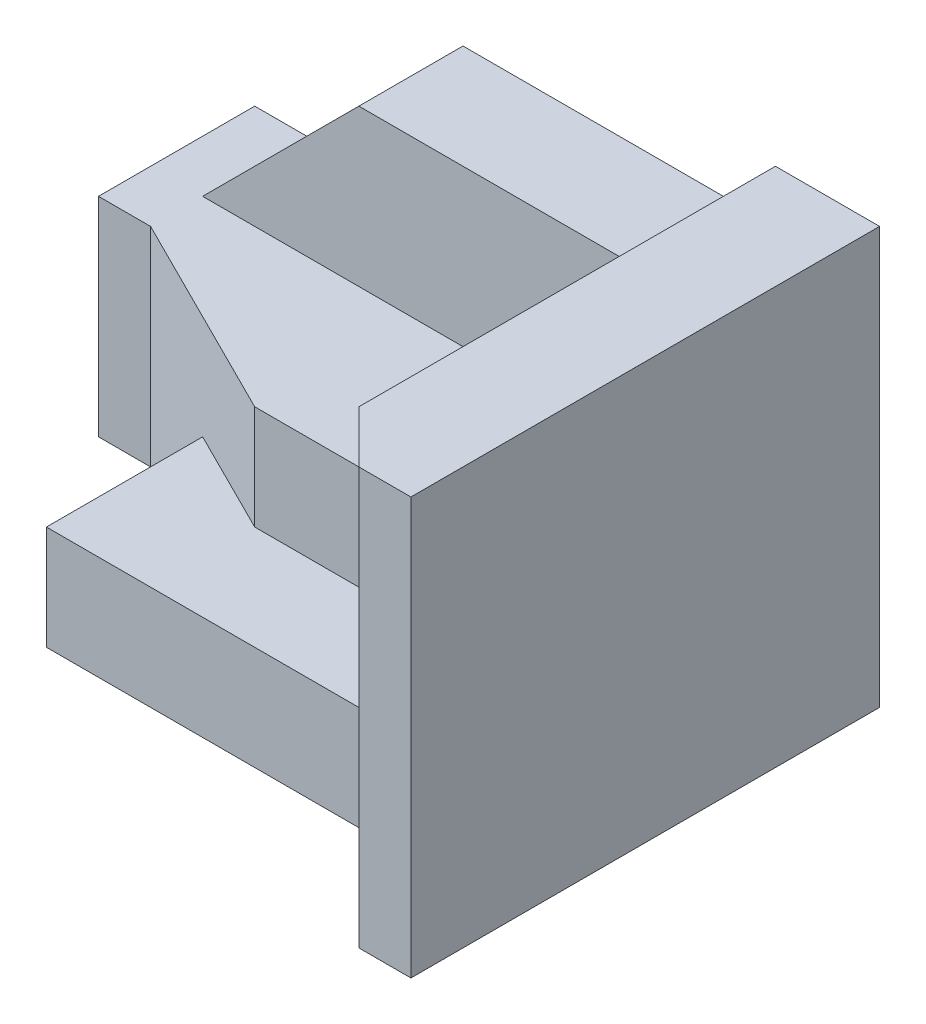
ISO-10303-21;
HEADER;
FILE_DESCRIPTION(('STEP AP214'),'2;1');
FILE_NAME('part.step','',(''),(''),'','','');
FILE_SCHEMA(('AUTOMOTIVE_DESIGN { 1 0 10303 214 1 1 1 1 }'));
ENDSEC;
DATA;
#1=APPLICATION_CONTEXT('core data for automotive mechanical design processes');
#2=APPLICATION_PROTOCOL_DEFINITION('international standard','automotive_design',2000,#1);
#3=PRODUCT_CONTEXT('',#1,'mechanical');
#4=PRODUCT('Part','Part','',(#3));
#5=PRODUCT_RELATED_PRODUCT_CATEGORY('part','',(#4));
#6=PRODUCT_DEFINITION_FORMATION('','',#4);
#7=PRODUCT_DEFINITION_CONTEXT('part definition',#1,'design');
#8=PRODUCT_DEFINITION('design','',#6,#7);
#9=PRODUCT_DEFINITION_SHAPE('','',#8);
#10=(LENGTH_UNIT() NAMED_UNIT(*) SI_UNIT(.MILLI.,.METRE.));
#11=(NAMED_UNIT(*) PLANE_ANGLE_UNIT() SI_UNIT($,.RADIAN.));
#12=(NAMED_UNIT(*) SI_UNIT($,.STERADIAN.) SOLID_ANGLE_UNIT());
#13=UNCERTAINTY_MEASURE_WITH_UNIT(LENGTH_MEASURE(1.E-05),#10,'distance_accuracy_value','');
#14=(GEOMETRIC_REPRESENTATION_CONTEXT(3) GLOBAL_UNCERTAINTY_ASSIGNED_CONTEXT((#13)) GLOBAL_UNIT_ASSIGNED_CONTEXT((#10,
#11,#12)) REPRESENTATION_CONTEXT('',''));
#15=CARTESIAN_POINT('',(0.,0.,0.));
#16=DIRECTION('',(0.,0.,1.));
#17=DIRECTION('',(1.,0.,0.));
#18=AXIS2_PLACEMENT_3D('',#15,#16,#17);
#19=CARTESIAN_POINT('',(90.,90.,-20.));
#20=DIRECTION('',(0.707106781186547,0.,-0.707106781186547));
#21=DIRECTION('',(-0.707106781186548,0.,-0.707106781186547));
#22=AXIS2_PLACEMENT_3D('',#19,#20,#21);
#23=PLANE('',#22);
#24=DIRECTION('',(0.577350269189626,0.577350269189626,0.577350269189626));
#25=VECTOR('',#24,1.);
#26=CARTESIAN_POINT('',(100.,70.,-10.));
#27=LINE('',#26,#25);
#28=CARTESIAN_POINT('',(70.,40.,-40.));
#29=VERTEX_POINT('',#28);
#30=CARTESIAN_POINT('',(100.,70.,-9.99999999999997));
#31=VERTEX_POINT('',#30);
#32=EDGE_CURVE('E308',#29,#31,#27,.T.);
#33=ORIENTED_EDGE('',*,*,#32,.F.);
#34=DIRECTION('',(0.,-1.,0.));
#35=VECTOR('',#34,1.);
#36=CARTESIAN_POINT('',(70.,110.,-40.));
#37=LINE('',#36,#35);
#38=CARTESIAN_POINT('',(70.,20.,-40.));
#39=VERTEX_POINT('',#38);
#40=EDGE_CURVE('E186',#29,#39,#37,.T.);
#41=ORIENTED_EDGE('',*,*,#40,.T.);
#42=DIRECTION('',(-0.707106781186548,0.,-0.707106781186547));
#43=VECTOR('',#42,1.);
#44=CARTESIAN_POINT('',(70.,20.,-40.));
#45=LINE('',#44,#43);
#46=CARTESIAN_POINT('',(90.,20.,-20.));
#47=VERTEX_POINT('',#46);
#48=EDGE_CURVE('E175',#47,#39,#45,.T.);
#49=ORIENTED_EDGE('',*,*,#48,.F.);
#50=DIRECTION('',(0.,-1.,0.));
#51=VECTOR('',#50,1.);
#52=CARTESIAN_POINT('',(90.,90.,-20.));
#53=LINE('',#52,#51);
#54=CARTESIAN_POINT('',(90.,0.,-20.));
#55=VERTEX_POINT('',#54);
#56=EDGE_CURVE('E207',#47,#55,#53,.T.);
#57=ORIENTED_EDGE('',*,*,#56,.T.);
#58=DIRECTION('',(0.707106781186548,0.,0.707106781186547));
#59=VECTOR('',#58,1.);
#60=CARTESIAN_POINT('',(90.,0.,-20.));
#61=LINE('',#60,#59);
#62=CARTESIAN_POINT('',(110.,0.,0.));
#63=VERTEX_POINT('',#62);
#64=EDGE_CURVE('E200',#55,#63,#61,.T.);
#65=ORIENTED_EDGE('',*,*,#64,.T.);
#66=DIRECTION('',(0.,-1.,0.));
#67=VECTOR('',#66,1.);
#68=CARTESIAN_POINT('',(110.,90.,0.));
#69=LINE('',#68,#67);
#70=CARTESIAN_POINT('',(110.,80.,0.));
#71=VERTEX_POINT('',#70);
#72=EDGE_CURVE('E203',#71,#63,#69,.T.);
#73=ORIENTED_EDGE('',*,*,#72,.F.);
#74=DIRECTION('',(-0.707106781186548,0.,-0.707106781186548));
#75=VECTOR('',#74,1.);
#76=CARTESIAN_POINT('',(9.99999999999999,80.,-100.));
#77=LINE('',#76,#75);
#78=CARTESIAN_POINT('',(100.,80.,-9.99999999999999));
#79=VERTEX_POINT('',#78);
#80=EDGE_CURVE('E218',#71,#79,#77,.T.);
#81=ORIENTED_EDGE('',*,*,#80,.T.);
#82=DIRECTION('',(0.,1.,0.));
#83=VECTOR('',#82,1.);
#84=CARTESIAN_POINT('',(100.,70.,-9.99999999999999));
#85=LINE('',#84,#83);
#86=EDGE_CURVE('E206',#31,#79,#85,.T.);
#87=ORIENTED_EDGE('',*,*,#86,.F.);
#88=EDGE_LOOP('',(#33,#41,#49,#57,#65,#73,#81,#87));
#89=FACE_BOUND('',#88,.T.);
#90=ADVANCED_FACE('F33',(#89),#23,.F.);
#91=CARTESIAN_POINT('',(40.,70.,-90.));
#92=DIRECTION('',(0.,-1.,0.));
#93=DIRECTION('',(0.,0.,-1.));
#94=AXIS2_PLACEMENT_3D('',#91,#92,#93);
#95=PLANE('',#94);
#96=DIRECTION('',(-1.,0.,0.));
#97=VECTOR('',#96,1.);
#98=CARTESIAN_POINT('',(40.,70.,-70.));
#99=LINE('',#98,#97);
#100=CARTESIAN_POINT('',(100.,70.,-70.));
#101=VERTEX_POINT('',#100);
#102=CARTESIAN_POINT('',(40.,70.,-70.));
#103=VERTEX_POINT('',#102);
#104=EDGE_CURVE('E169',#101,#103,#99,.T.);
#105=ORIENTED_EDGE('',*,*,#104,.F.);
#106=DIRECTION('',(0.,0.,1.));
#107=VECTOR('',#106,1.);
#108=CARTESIAN_POINT('',(100.,70.,-90.));
#109=LINE('',#108,#107);
#110=CARTESIAN_POINT('',(100.,70.,-90.));
#111=VERTEX_POINT('',#110);
#112=EDGE_CURVE('E237',#111,#101,#109,.T.);
#113=ORIENTED_EDGE('',*,*,#112,.F.);
#114=DIRECTION('',(1.,0.,0.));
#115=VECTOR('',#114,1.);
#116=CARTESIAN_POINT('',(40.,70.,-90.));
#117=LINE('',#116,#115);
#118=CARTESIAN_POINT('',(40.,70.,-90.));
#119=VERTEX_POINT('',#118);
#120=EDGE_CURVE('E226',#119,#111,#117,.T.);
#121=ORIENTED_EDGE('',*,*,#120,.F.);
#122=DIRECTION('',(0.,0.,1.));
#123=VECTOR('',#122,1.);
#124=CARTESIAN_POINT('',(40.,70.,-90.));
#125=LINE('',#124,#123);
#126=EDGE_CURVE('E239',#119,#103,#125,.T.);
#127=ORIENTED_EDGE('',*,*,#126,.T.);
#128=EDGE_LOOP('',(#105,#113,#121,#127));
#129=FACE_BOUND('',#128,.T.);
#130=ADVANCED_FACE('F307',(#129),#95,.F.);
#131=CARTESIAN_POINT('',(10.,40.,-90.));
#132=DIRECTION('',(0.707106781186547,-0.707106781186547,0.));
#133=DIRECTION('',(0.707106781186548,0.707106781186548,0.));
#134=AXIS2_PLACEMENT_3D('',#131,#132,#133);
#135=PLANE('',#134);
#136=DIRECTION('',(-0.707106781186547,-0.707106781186547,0.));
#137=VECTOR('',#136,1.);
#138=CARTESIAN_POINT('',(10.,40.,-70.));
#139=LINE('',#138,#137);
#140=CARTESIAN_POINT('',(10.,40.,-70.));
#141=VERTEX_POINT('',#140);
#142=EDGE_CURVE('E11',#103,#141,#139,.T.);
#143=ORIENTED_EDGE('',*,*,#142,.F.);
#144=ORIENTED_EDGE('',*,*,#126,.F.);
#145=DIRECTION('',(0.707106781186547,0.707106781186548,0.));
#146=VECTOR('',#145,1.);
#147=CARTESIAN_POINT('',(10.,40.,-90.));
#148=LINE('',#147,#146);
#149=CARTESIAN_POINT('',(10.,40.,-90.));
#150=VERTEX_POINT('',#149);
#151=EDGE_CURVE('E223',#150,#119,#148,.T.);
#152=ORIENTED_EDGE('',*,*,#151,.F.);
#153=DIRECTION('',(0.,0.,1.));
#154=VECTOR('',#153,1.);
#155=CARTESIAN_POINT('',(10.,40.,-90.));
#156=LINE('',#155,#154);
#157=EDGE_CURVE('E242',#150,#141,#156,.T.);
#158=ORIENTED_EDGE('',*,*,#157,.T.);
#159=EDGE_LOOP('',(#143,#144,#152,#158));
#160=FACE_BOUND('',#159,.T.);
#161=ADVANCED_FACE('F341',(#160),#135,.F.);
#162=CARTESIAN_POINT('',(10.,90.,-60.));
#163=DIRECTION('',(0.447213595499958,0.,-0.894427190999916));
#164=DIRECTION('',(-0.894427190999916,0.,-0.447213595499958));
#165=AXIS2_PLACEMENT_3D('',#162,#163,#164);
#166=PLANE('',#165);
#167=DIRECTION('',(0.894427190999916,0.,0.447213595499958));
#168=VECTOR('',#167,1.);
#169=CARTESIAN_POINT('',(10.,40.,-60.));
#170=LINE('',#169,#168);
#171=CARTESIAN_POINT('',(10.,40.,-60.));
#172=VERTEX_POINT('',#171);
#173=CARTESIAN_POINT('',(50.,40.,-40.));
#174=VERTEX_POINT('',#173);
#175=EDGE_CURVE('E48',#172,#174,#170,.T.);
#176=ORIENTED_EDGE('',*,*,#175,.F.);
#177=DIRECTION('',(0.,-1.,0.));
#178=VECTOR('',#177,1.);
#179=CARTESIAN_POINT('',(10.,90.,-60.));
#180=LINE('',#179,#178);
#181=CARTESIAN_POINT('',(10.,0.,-60.));
#182=VERTEX_POINT('',#181);
#183=EDGE_CURVE('E213',#172,#182,#180,.T.);
#184=ORIENTED_EDGE('',*,*,#183,.T.);
#185=DIRECTION('',(0.894427190999916,0.,0.447213595499958));
#186=VECTOR('',#185,1.);
#187=CARTESIAN_POINT('',(10.,0.,-60.));
#188=LINE('',#187,#186);
#189=CARTESIAN_POINT('',(30.,0.,-50.));
#190=VERTEX_POINT('',#189);
#191=EDGE_CURVE('E191',#182,#190,#188,.T.);
#192=ORIENTED_EDGE('',*,*,#191,.T.);
#193=DIRECTION('',(0.,-1.,0.));
#194=VECTOR('',#193,1.);
#195=CARTESIAN_POINT('',(30.,90.,-50.));
#196=LINE('',#195,#194);
#197=CARTESIAN_POINT('',(30.,20.,-50.));
#198=VERTEX_POINT('',#197);
#199=EDGE_CURVE('E211',#198,#190,#196,.T.);
#200=ORIENTED_EDGE('',*,*,#199,.F.);
#201=DIRECTION('',(-0.894427190999916,0.,-0.447213595499958));
#202=VECTOR('',#201,1.);
#203=CARTESIAN_POINT('',(30.,20.,-50.));
#204=LINE('',#203,#202);
#205=CARTESIAN_POINT('',(50.,20.,-40.));
#206=VERTEX_POINT('',#205);
#207=EDGE_CURVE('E180',#206,#198,#204,.T.);
#208=ORIENTED_EDGE('',*,*,#207,.F.);
#209=DIRECTION('',(0.,-1.,0.));
#210=VECTOR('',#209,1.);
#211=CARTESIAN_POINT('',(50.,110.,-40.));
#212=LINE('',#211,#210);
#213=EDGE_CURVE('E184',#174,#206,#212,.T.);
#214=ORIENTED_EDGE('',*,*,#213,.F.);
#215=EDGE_LOOP('',(#176,#184,#192,#200,#208,#214));
#216=FACE_BOUND('',#215,.T.);
#217=ADVANCED_FACE('F319',(#216),#166,.F.);
#218=CARTESIAN_POINT('',(50.,110.,-40.));
#219=DIRECTION('',(0.,0.,1.));
#220=DIRECTION('',(1.,0.,0.));
#221=AXIS2_PLACEMENT_3D('',#218,#219,#220);
#222=PLANE('',#221);
#223=ORIENTED_EDGE('',*,*,#40,.F.);
#224=DIRECTION('',(1.,0.,0.));
#225=VECTOR('',#224,1.);
#226=CARTESIAN_POINT('',(50.,40.,-40.));
#227=LINE('',#226,#225);
#228=EDGE_CURVE('E163',#174,#29,#227,.T.);
#229=ORIENTED_EDGE('',*,*,#228,.F.);
#230=ORIENTED_EDGE('',*,*,#213,.T.);
#231=DIRECTION('',(-1.,0.,0.));
#232=VECTOR('',#231,1.);
#233=CARTESIAN_POINT('',(50.,20.,-40.));
#234=LINE('',#233,#232);
#235=EDGE_CURVE('E177',#39,#206,#234,.T.);
#236=ORIENTED_EDGE('',*,*,#235,.F.);
#237=EDGE_LOOP('',(#223,#229,#230,#236));
#238=FACE_BOUND('',#237,.T.);
#239=ADVANCED_FACE('F316',(#238),#222,.T.);
#240=CARTESIAN_POINT('',(0.,0.,-90.));
#241=DIRECTION('',(-1.,0.,0.));
#242=DIRECTION('',(0.,0.,1.));
#243=AXIS2_PLACEMENT_3D('',#240,#241,#242);
#244=PLANE('',#243);
#245=DIRECTION('',(0.,-1.,0.));
#246=VECTOR('',#245,1.);
#247=CARTESIAN_POINT('',(0.,90.,-60.));
#248=LINE('',#247,#246);
#249=CARTESIAN_POINT('',(0.,40.,-60.));
#250=VERTEX_POINT('',#249);
#251=CARTESIAN_POINT('',(0.,0.,-60.));
#252=VERTEX_POINT('',#251);
#253=EDGE_CURVE('E202',#250,#252,#248,.T.);
#254=ORIENTED_EDGE('',*,*,#253,.F.);
#255=DIRECTION('',(0.,0.,1.));
#256=VECTOR('',#255,1.);
#257=CARTESIAN_POINT('',(0.,40.,-90.));
#258=LINE('',#257,#256);
#259=CARTESIAN_POINT('',(0.,40.,-90.));
#260=VERTEX_POINT('',#259);
#261=EDGE_CURVE('E232',#260,#250,#258,.T.);
#262=ORIENTED_EDGE('',*,*,#261,.F.);
#263=DIRECTION('',(0.,-1.,0.));
#264=VECTOR('',#263,1.);
#265=CARTESIAN_POINT('',(0.,0.,-90.));
#266=LINE('',#265,#264);
#267=CARTESIAN_POINT('',(0.,0.,-90.));
#268=VERTEX_POINT('',#267);
#269=EDGE_CURVE('E245',#260,#268,#266,.T.);
#270=ORIENTED_EDGE('',*,*,#269,.T.);
#271=DIRECTION('',(0.,0.,1.));
#272=VECTOR('',#271,1.);
#273=CARTESIAN_POINT('',(0.,0.,-90.));
#274=LINE('',#273,#272);
#275=EDGE_CURVE('E257',#268,#252,#274,.T.);
#276=ORIENTED_EDGE('',*,*,#275,.T.);
#277=EDGE_LOOP('',(#254,#262,#270,#276));
#278=FACE_BOUND('',#277,.T.);
#279=ADVANCED_FACE('F35',(#278),#244,.T.);
#280=CARTESIAN_POINT('',(0.,80.,-90.));
#281=DIRECTION('',(0.,1.,0.));
#282=DIRECTION('',(0.,0.,1.));
#283=AXIS2_PLACEMENT_3D('',#280,#281,#282);
#284=PLANE('',#283);
#285=ORIENTED_EDGE('',*,*,#80,.F.);
#286=DIRECTION('',(-1.,0.,0.));
#287=VECTOR('',#286,1.);
#288=CARTESIAN_POINT('',(0.,80.,0.));
#289=LINE('',#288,#287);
#290=CARTESIAN_POINT('',(120.,80.,0.));
#291=VERTEX_POINT('',#290);
#292=EDGE_CURVE('E248',#291,#71,#289,.T.);
#293=ORIENTED_EDGE('',*,*,#292,.F.);
#294=DIRECTION('',(0.,0.,1.));
#295=VECTOR('',#294,1.);
#296=CARTESIAN_POINT('',(120.,80.,-90.));
#297=LINE('',#296,#295);
#298=CARTESIAN_POINT('',(120.,80.,-90.));
#299=VERTEX_POINT('',#298);
#300=EDGE_CURVE('E264',#299,#291,#297,.T.);
#301=ORIENTED_EDGE('',*,*,#300,.F.);
#302=DIRECTION('',(-1.,0.,0.));
#303=VECTOR('',#302,1.);
#304=CARTESIAN_POINT('',(0.,80.,-90.));
#305=LINE('',#304,#303);
#306=CARTESIAN_POINT('',(100.,80.,-90.));
#307=VERTEX_POINT('',#306);
#308=EDGE_CURVE('E254',#299,#307,#305,.T.);
#309=ORIENTED_EDGE('',*,*,#308,.T.);
#310=DIRECTION('',(0.,0.,1.));
#311=VECTOR('',#310,1.);
#312=CARTESIAN_POINT('',(100.,80.,-90.));
#313=LINE('',#312,#311);
#314=EDGE_CURVE('E233',#307,#79,#313,.T.);
#315=ORIENTED_EDGE('',*,*,#314,.T.);
#316=EDGE_LOOP('',(#285,#293,#301,#309,#315));
#317=FACE_BOUND('',#316,.T.);
#318=ADVANCED_FACE('F300',(#317),#284,.T.);
#319=CARTESIAN_POINT('',(120.,0.,-90.));
#320=DIRECTION('',(1.,0.,0.));
#321=DIRECTION('',(0.,0.,-1.));
#322=AXIS2_PLACEMENT_3D('',#319,#320,#321);
#323=PLANE('',#322);
#324=DIRECTION('',(0.,1.,0.));
#325=VECTOR('',#324,1.);
#326=CARTESIAN_POINT('',(120.,0.,0.));
#327=LINE('',#326,#325);
#328=CARTESIAN_POINT('',(120.,0.,0.));
#329=VERTEX_POINT('',#328);
#330=EDGE_CURVE('E259',#329,#291,#327,.T.);
#331=ORIENTED_EDGE('',*,*,#330,.F.);
#332=DIRECTION('',(0.,0.,1.));
#333=VECTOR('',#332,1.);
#334=CARTESIAN_POINT('',(120.,0.,-90.));
#335=LINE('',#334,#333);
#336=CARTESIAN_POINT('',(120.,0.,-90.));
#337=VERTEX_POINT('',#336);
#338=EDGE_CURVE('E266',#337,#329,#335,.T.);
#339=ORIENTED_EDGE('',*,*,#338,.F.);
#340=DIRECTION('',(0.,1.,0.));
#341=VECTOR('',#340,1.);
#342=CARTESIAN_POINT('',(120.,0.,-90.));
#343=LINE('',#342,#341);
#344=EDGE_CURVE('E251',#337,#299,#343,.T.);
#345=ORIENTED_EDGE('',*,*,#344,.T.);
#346=ORIENTED_EDGE('',*,*,#300,.T.);
#347=EDGE_LOOP('',(#331,#339,#345,#346));
#348=FACE_BOUND('',#347,.T.);
#349=ADVANCED_FACE('F290',(#348),#323,.T.);
#350=CARTESIAN_POINT('',(0.,0.,-90.));
#351=DIRECTION('',(0.,-1.,0.));
#352=DIRECTION('',(0.,0.,-1.));
#353=AXIS2_PLACEMENT_3D('',#350,#351,#352);
#354=PLANE('',#353);
#355=ORIENTED_EDGE('',*,*,#64,.F.);
#356=DIRECTION('',(1.,0.,0.));
#357=VECTOR('',#356,1.);
#358=CARTESIAN_POINT('',(30.,0.,-20.));
#359=LINE('',#358,#357);
#360=CARTESIAN_POINT('',(30.,0.,-20.));
#361=VERTEX_POINT('',#360);
#362=EDGE_CURVE('E197',#361,#55,#359,.T.);
#363=ORIENTED_EDGE('',*,*,#362,.F.);
#364=DIRECTION('',(0.,0.,1.));
#365=VECTOR('',#364,1.);
#366=CARTESIAN_POINT('',(30.,0.,-50.));
#367=LINE('',#366,#365);
#368=EDGE_CURVE('E194',#190,#361,#367,.T.);
#369=ORIENTED_EDGE('',*,*,#368,.F.);
#370=ORIENTED_EDGE('',*,*,#191,.F.);
#371=DIRECTION('',(1.,0.,0.));
#372=VECTOR('',#371,1.);
#373=CARTESIAN_POINT('',(0.,0.,-60.));
#374=LINE('',#373,#372);
#375=EDGE_CURVE('E188',#252,#182,#374,.T.);
#376=ORIENTED_EDGE('',*,*,#375,.F.);
#377=ORIENTED_EDGE('',*,*,#275,.F.);
#378=DIRECTION('',(1.,0.,0.));
#379=VECTOR('',#378,1.);
#380=CARTESIAN_POINT('',(0.,0.,-90.));
#381=LINE('',#380,#379);
#382=EDGE_CURVE('E247',#268,#337,#381,.T.);
#383=ORIENTED_EDGE('',*,*,#382,.T.);
#384=ORIENTED_EDGE('',*,*,#338,.T.);
#385=DIRECTION('',(1.,0.,0.));
#386=VECTOR('',#385,1.);
#387=CARTESIAN_POINT('',(0.,0.,0.));
#388=LINE('',#387,#386);
#389=EDGE_CURVE('E236',#63,#329,#388,.T.);
#390=ORIENTED_EDGE('',*,*,#389,.F.);
#391=EDGE_LOOP('',(#355,#363,#369,#370,#376,#377,#383,#384,#390));
#392=FACE_BOUND('',#391,.T.);
#393=ADVANCED_FACE('F282',(#392),#354,.T.);
#394=CARTESIAN_POINT('',(0.,0.,-90.));
#395=DIRECTION('',(0.,0.,-1.));
#396=DIRECTION('',(-1.,0.,0.));
#397=AXIS2_PLACEMENT_3D('',#394,#395,#396);
#398=PLANE('',#397);
#399=DIRECTION('',(0.,1.,0.));
#400=VECTOR('',#399,1.);
#401=CARTESIAN_POINT('',(100.,70.,-90.));
#402=LINE('',#401,#400);
#403=EDGE_CURVE('E229',#111,#307,#402,.T.);
#404=ORIENTED_EDGE('',*,*,#403,.T.);
#405=ORIENTED_EDGE('',*,*,#308,.F.);
#406=ORIENTED_EDGE('',*,*,#344,.F.);
#407=ORIENTED_EDGE('',*,*,#382,.F.);
#408=ORIENTED_EDGE('',*,*,#269,.F.);
#409=DIRECTION('',(1.,0.,0.));
#410=VECTOR('',#409,1.);
#411=CARTESIAN_POINT('',(0.,40.,-90.));
#412=LINE('',#411,#410);
#413=EDGE_CURVE('E220',#260,#150,#412,.T.);
#414=ORIENTED_EDGE('',*,*,#413,.T.);
#415=ORIENTED_EDGE('',*,*,#151,.T.);
#416=ORIENTED_EDGE('',*,*,#120,.T.);
#417=EDGE_LOOP('',(#404,#405,#406,#407,#408,#414,#415,#416));
#418=FACE_BOUND('',#417,.T.);
#419=ADVANCED_FACE('F286',(#418),#398,.T.);
#420=CARTESIAN_POINT('',(0.,0.,0.));
#421=DIRECTION('',(0.,0.,-1.));
#422=DIRECTION('',(-1.,0.,0.));
#423=AXIS2_PLACEMENT_3D('',#420,#421,#422);
#424=PLANE('',#423);
#425=ORIENTED_EDGE('',*,*,#292,.T.);
#426=ORIENTED_EDGE('',*,*,#72,.T.);
#427=ORIENTED_EDGE('',*,*,#389,.T.);
#428=ORIENTED_EDGE('',*,*,#330,.T.);
#429=EDGE_LOOP('',(#425,#426,#427,#428));
#430=FACE_BOUND('',#429,.T.);
#431=ADVANCED_FACE('F294',(#430),#424,.F.);
#432=CARTESIAN_POINT('',(100.,70.,-90.));
#433=DIRECTION('',(1.,0.,0.));
#434=DIRECTION('',(0.,0.,-1.));
#435=AXIS2_PLACEMENT_3D('',#432,#433,#434);
#436=PLANE('',#435);
#437=ORIENTED_EDGE('',*,*,#112,.T.);
#438=DIRECTION('',(0.,0.,-1.));
#439=VECTOR('',#438,1.);
#440=CARTESIAN_POINT('',(100.,70.,20.));
#441=LINE('',#440,#439);
#442=EDGE_CURVE('E153',#31,#101,#441,.T.);
#443=ORIENTED_EDGE('',*,*,#442,.F.);
#444=ORIENTED_EDGE('',*,*,#86,.T.);
#445=ORIENTED_EDGE('',*,*,#314,.F.);
#446=ORIENTED_EDGE('',*,*,#403,.F.);
#447=EDGE_LOOP('',(#437,#443,#444,#445,#446));
#448=FACE_BOUND('',#447,.T.);
#449=ADVANCED_FACE('F303',(#448),#436,.F.);
#450=CARTESIAN_POINT('',(0.,40.,-90.));
#451=DIRECTION('',(0.,-1.,0.));
#452=DIRECTION('',(0.,0.,-1.));
#453=AXIS2_PLACEMENT_3D('',#450,#451,#452);
#454=PLANE('',#453);
#455=ORIENTED_EDGE('',*,*,#261,.T.);
#456=DIRECTION('',(1.,0.,0.));
#457=VECTOR('',#456,1.);
#458=CARTESIAN_POINT('',(0.,40.,-60.));
#459=LINE('',#458,#457);
#460=EDGE_CURVE('E41',#250,#172,#459,.T.);
#461=ORIENTED_EDGE('',*,*,#460,.T.);
#462=ORIENTED_EDGE('',*,*,#175,.T.);
#463=ORIENTED_EDGE('',*,*,#228,.T.);
#464=DIRECTION('',(0.,0.,-1.));
#465=VECTOR('',#464,1.);
#466=CARTESIAN_POINT('',(70.,40.,-40.));
#467=LINE('',#466,#465);
#468=CARTESIAN_POINT('',(70.,40.,-70.));
#469=VERTEX_POINT('',#468);
#470=EDGE_CURVE('E150',#29,#469,#467,.T.);
#471=ORIENTED_EDGE('',*,*,#470,.T.);
#472=DIRECTION('',(-1.,0.,0.));
#473=VECTOR('',#472,1.);
#474=CARTESIAN_POINT('',(70.,40.,-70.));
#475=LINE('',#474,#473);
#476=EDGE_CURVE('E161',#469,#141,#475,.T.);
#477=ORIENTED_EDGE('',*,*,#476,.T.);
#478=ORIENTED_EDGE('',*,*,#157,.F.);
#479=ORIENTED_EDGE('',*,*,#413,.F.);
#480=EDGE_LOOP('',(#455,#461,#462,#463,#471,#477,#478,#479));
#481=FACE_BOUND('',#480,.T.);
#482=ADVANCED_FACE('F160',(#481),#454,.F.);
#483=CARTESIAN_POINT('',(30.,90.,-20.));
#484=DIRECTION('',(0.,0.,-1.));
#485=DIRECTION('',(-1.,0.,0.));
#486=AXIS2_PLACEMENT_3D('',#483,#484,#485);
#487=PLANE('',#486);
#488=ORIENTED_EDGE('',*,*,#56,.F.);
#489=DIRECTION('',(1.,0.,0.));
#490=VECTOR('',#489,1.);
#491=CARTESIAN_POINT('',(90.,20.,-20.));
#492=LINE('',#491,#490);
#493=CARTESIAN_POINT('',(30.,20.,-20.));
#494=VERTEX_POINT('',#493);
#495=EDGE_CURVE('E56',#494,#47,#492,.T.);
#496=ORIENTED_EDGE('',*,*,#495,.F.);
#497=DIRECTION('',(0.,-1.,0.));
#498=VECTOR('',#497,1.);
#499=CARTESIAN_POINT('',(30.,90.,-20.));
#500=LINE('',#499,#498);
#501=EDGE_CURVE('E209',#494,#361,#500,.T.);
#502=ORIENTED_EDGE('',*,*,#501,.T.);
#503=ORIENTED_EDGE('',*,*,#362,.T.);
#504=EDGE_LOOP('',(#488,#496,#502,#503));
#505=FACE_BOUND('',#504,.T.);
#506=ADVANCED_FACE('F327',(#505),#487,.F.);
#507=CARTESIAN_POINT('',(30.,90.,-50.));
#508=DIRECTION('',(1.,0.,0.));
#509=DIRECTION('',(0.,0.,-1.));
#510=AXIS2_PLACEMENT_3D('',#507,#508,#509);
#511=PLANE('',#510);
#512=ORIENTED_EDGE('',*,*,#501,.F.);
#513=DIRECTION('',(0.,0.,1.));
#514=VECTOR('',#513,1.);
#515=CARTESIAN_POINT('',(30.,20.,-20.));
#516=LINE('',#515,#514);
#517=EDGE_CURVE('E182',#198,#494,#516,.T.);
#518=ORIENTED_EDGE('',*,*,#517,.F.);
#519=ORIENTED_EDGE('',*,*,#199,.T.);
#520=ORIENTED_EDGE('',*,*,#368,.T.);
#521=EDGE_LOOP('',(#512,#518,#519,#520));
#522=FACE_BOUND('',#521,.T.);
#523=ADVANCED_FACE('F324',(#522),#511,.F.);
#524=CARTESIAN_POINT('',(0.,90.,-60.));
#525=DIRECTION('',(0.,0.,-1.));
#526=DIRECTION('',(-1.,0.,0.));
#527=AXIS2_PLACEMENT_3D('',#524,#525,#526);
#528=PLANE('',#527);
#529=ORIENTED_EDGE('',*,*,#253,.T.);
#530=ORIENTED_EDGE('',*,*,#375,.T.);
#531=ORIENTED_EDGE('',*,*,#183,.F.);
#532=ORIENTED_EDGE('',*,*,#460,.F.);
#533=EDGE_LOOP('',(#529,#530,#531,#532));
#534=FACE_BOUND('',#533,.T.);
#535=ADVANCED_FACE('F274',(#534),#528,.F.);
#536=CARTESIAN_POINT('',(0.,20.,0.));
#537=DIRECTION('',(0.,-1.,0.));
#538=DIRECTION('',(0.,0.,-1.));
#539=AXIS2_PLACEMENT_3D('',#536,#537,#538);
#540=PLANE('',#539);
#541=ORIENTED_EDGE('',*,*,#495,.T.);
#542=ORIENTED_EDGE('',*,*,#48,.T.);
#543=ORIENTED_EDGE('',*,*,#235,.T.);
#544=ORIENTED_EDGE('',*,*,#207,.T.);
#545=ORIENTED_EDGE('',*,*,#517,.T.);
#546=EDGE_LOOP('',(#541,#542,#543,#544,#545));
#547=FACE_BOUND('',#546,.T.);
#548=ADVANCED_FACE('F314',(#547),#540,.F.);
#549=CARTESIAN_POINT('',(70.,130.,-70.));
#550=DIRECTION('',(0.,0.,1.));
#551=DIRECTION('',(1.,0.,0.));
#552=AXIS2_PLACEMENT_3D('',#549,#550,#551);
#553=PLANE('',#552);
#554=ORIENTED_EDGE('',*,*,#104,.T.);
#555=ORIENTED_EDGE('',*,*,#142,.T.);
#556=ORIENTED_EDGE('',*,*,#476,.F.);
#557=DIRECTION('',(0.707106781186547,0.707106781186548,0.));
#558=VECTOR('',#557,1.);
#559=CARTESIAN_POINT('',(70.,40.,-70.));
#560=LINE('',#559,#558);
#561=EDGE_CURVE('E147',#469,#101,#560,.T.);
#562=ORIENTED_EDGE('',*,*,#561,.T.);
#563=EDGE_LOOP('',(#554,#555,#556,#562));
#564=FACE_BOUND('',#563,.T.);
#565=ADVANCED_FACE('F166',(#564),#553,.T.);
#566=CARTESIAN_POINT('',(70.,40.,20.));
#567=DIRECTION('',(-0.707106781186547,0.707106781186547,0.));
#568=DIRECTION('',(-0.707106781186548,-0.707106781186548,0.));
#569=AXIS2_PLACEMENT_3D('',#566,#567,#568);
#570=PLANE('',#569);
#571=ORIENTED_EDGE('',*,*,#32,.T.);
#572=ORIENTED_EDGE('',*,*,#442,.T.);
#573=ORIENTED_EDGE('',*,*,#561,.F.);
#574=ORIENTED_EDGE('',*,*,#470,.F.);
#575=EDGE_LOOP('',(#571,#572,#573,#574));
#576=FACE_BOUND('',#575,.T.);
#577=ADVANCED_FACE('F149',(#576),#570,.T.);
#578=CLOSED_SHELL('',(#90,#130,#161,#217,#239,#279,#318,#349,#393,#419,#431,#449,#482,#506,#523,
#535,#548,#565,#577));
#579=MANIFOLD_SOLID_BREP('B2',#578);
#580=ADVANCED_BREP_SHAPE_REPRESENTATION('',(#18,#579),#14);
#581=SHAPE_DEFINITION_REPRESENTATION(#9,#580);
ENDSEC;
END-ISO-10303-21;
